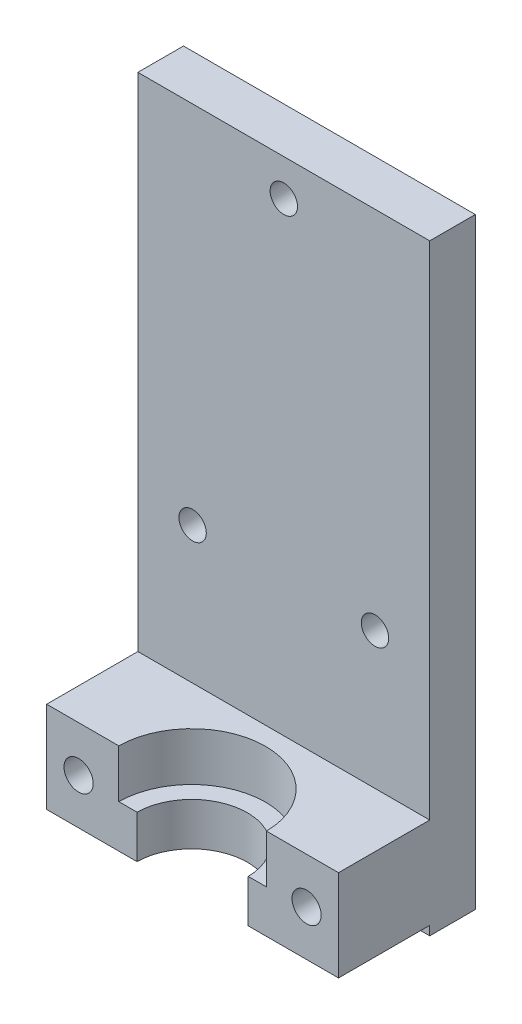
ISO-10303-21;
HEADER;
FILE_DESCRIPTION(('STEP AP214'),'2;1');
FILE_NAME('part.step','',(''),(''),'','','');
FILE_SCHEMA(('AUTOMOTIVE_DESIGN { 1 0 10303 214 1 1 1 1 }'));
ENDSEC;
DATA;
#1=APPLICATION_CONTEXT('core data for automotive mechanical design processes');
#2=APPLICATION_PROTOCOL_DEFINITION('international standard','automotive_design',2000,#1);
#3=PRODUCT_CONTEXT('',#1,'mechanical');
#4=PRODUCT('Part','Part','',(#3));
#5=PRODUCT_RELATED_PRODUCT_CATEGORY('part','',(#4));
#6=PRODUCT_DEFINITION_FORMATION('','',#4);
#7=PRODUCT_DEFINITION_CONTEXT('part definition',#1,'design');
#8=PRODUCT_DEFINITION('design','',#6,#7);
#9=PRODUCT_DEFINITION_SHAPE('','',#8);
#10=(LENGTH_UNIT() NAMED_UNIT(*) SI_UNIT(.MILLI.,.METRE.));
#11=(NAMED_UNIT(*) PLANE_ANGLE_UNIT() SI_UNIT($,.RADIAN.));
#12=(NAMED_UNIT(*) SI_UNIT($,.STERADIAN.) SOLID_ANGLE_UNIT());
#13=UNCERTAINTY_MEASURE_WITH_UNIT(LENGTH_MEASURE(1.E-05),#10,'distance_accuracy_value','');
#14=(GEOMETRIC_REPRESENTATION_CONTEXT(3) GLOBAL_UNCERTAINTY_ASSIGNED_CONTEXT((#13)) GLOBAL_UNIT_ASSIGNED_CONTEXT((#10,
#11,#12)) REPRESENTATION_CONTEXT('',''));
#15=CARTESIAN_POINT('',(0.,0.,0.));
#16=DIRECTION('',(0.,0.,1.));
#17=DIRECTION('',(1.,0.,0.));
#18=AXIS2_PLACEMENT_3D('',#15,#16,#17);
#19=CARTESIAN_POINT('',(3.50000000000001,-60.,0.));
#20=DIRECTION('',(0.,0.,1.));
#21=DIRECTION('',(1.,0.,0.));
#22=AXIS2_PLACEMENT_3D('',#19,#20,#21);
#23=CYLINDRICAL_SURFACE('',#22,1.6);
#24=CARTESIAN_POINT('',(3.50000000000001,-60.,10.));
#25=DIRECTION('',(0.,0.,-1.));
#26=DIRECTION('',(-1.,0.,0.));
#27=AXIS2_PLACEMENT_3D('',#24,#25,#26);
#28=CIRCLE('',#27,1.6);
#29=CARTESIAN_POINT('',(1.90000000000002,-60.,10.));
#30=VERTEX_POINT('',#29);
#31=EDGE_CURVE('E294',#30,#30,#28,.F.);
#32=ORIENTED_EDGE('',*,*,#31,.F.);
#33=EDGE_LOOP('',(#32));
#34=FACE_BOUND('',#33,.T.);
#35=CARTESIAN_POINT('',(3.50000000000001,-60.,15.));
#36=DIRECTION('',(0.,0.,1.));
#37=DIRECTION('',(1.,0.,0.));
#38=AXIS2_PLACEMENT_3D('',#35,#36,#37);
#39=CIRCLE('',#38,1.6);
#40=CARTESIAN_POINT('',(5.10000000000001,-60.,15.));
#41=VERTEX_POINT('',#40);
#42=EDGE_CURVE('E390',#41,#41,#39,.F.);
#43=ORIENTED_EDGE('',*,*,#42,.F.);
#44=EDGE_LOOP('',(#43));
#45=FACE_BOUND('',#44,.T.);
#46=ADVANCED_FACE('F33',(#34,#45),#23,.F.);
#47=CARTESIAN_POINT('',(28.5,-60.,0.));
#48=DIRECTION('',(0.,0.,1.));
#49=DIRECTION('',(1.,0.,0.));
#50=AXIS2_PLACEMENT_3D('',#47,#48,#49);
#51=CYLINDRICAL_SURFACE('',#50,1.6);
#52=CARTESIAN_POINT('',(28.5,-60.,10.));
#53=DIRECTION('',(0.,0.,-1.));
#54=DIRECTION('',(-1.,0.,0.));
#55=AXIS2_PLACEMENT_3D('',#52,#53,#54);
#56=CIRCLE('',#55,1.6);
#57=CARTESIAN_POINT('',(26.9,-60.,10.));
#58=VERTEX_POINT('',#57);
#59=EDGE_CURVE('E289',#58,#58,#56,.F.);
#60=ORIENTED_EDGE('',*,*,#59,.F.);
#61=EDGE_LOOP('',(#60));
#62=FACE_BOUND('',#61,.T.);
#63=CARTESIAN_POINT('',(28.5,-60.,15.));
#64=DIRECTION('',(0.,0.,1.));
#65=DIRECTION('',(1.,0.,0.));
#66=AXIS2_PLACEMENT_3D('',#63,#64,#65);
#67=CIRCLE('',#66,1.6);
#68=CARTESIAN_POINT('',(30.1,-60.,15.));
#69=VERTEX_POINT('',#68);
#70=EDGE_CURVE('E380',#69,#69,#67,.F.);
#71=ORIENTED_EDGE('',*,*,#70,.F.);
#72=EDGE_LOOP('',(#71));
#73=FACE_BOUND('',#72,.T.);
#74=ADVANCED_FACE('F354',(#62,#73),#51,.F.);
#75=CARTESIAN_POINT('',(15.9996874969482,-66.,15.1));
#76=DIRECTION('',(0.,1.,0.));
#77=DIRECTION('',(0.,0.,1.));
#78=AXIS2_PLACEMENT_3D('',#75,#76,#77);
#79=CYLINDRICAL_SURFACE('',#78,6.1);
#80=DIRECTION('',(0.,1.,0.));
#81=VECTOR('',#80,1.);
#82=CARTESIAN_POINT('',(22.098867769739,-66.,15.));
#83=LINE('',#82,#81);
#84=CARTESIAN_POINT('',(22.098867769739,-60.3,15.));
#85=VERTEX_POINT('',#84);
#86=CARTESIAN_POINT('',(22.098867769739,-65.,15.));
#87=VERTEX_POINT('',#86);
#88=EDGE_CURVE('E379',#85,#87,#83,.F.);
#89=ORIENTED_EDGE('',*,*,#88,.F.);
#90=CARTESIAN_POINT('',(15.9996874969482,-60.3,15.1));
#91=DIRECTION('',(0.,1.,0.));
#92=DIRECTION('',(-1.,0.,0.));
#93=AXIS2_PLACEMENT_3D('',#90,#91,#92);
#94=CIRCLE('',#93,6.1);
#95=CARTESIAN_POINT('',(9.90050722415742,-60.3,15.));
#96=VERTEX_POINT('',#95);
#97=EDGE_CURVE('E222',#96,#85,#94,.F.);
#98=ORIENTED_EDGE('',*,*,#97,.F.);
#99=DIRECTION('',(0.,1.,0.));
#100=VECTOR('',#99,1.);
#101=CARTESIAN_POINT('',(9.90050722415742,-66.,15.));
#102=LINE('',#101,#100);
#103=CARTESIAN_POINT('',(9.90050722415742,-65.,15.));
#104=VERTEX_POINT('',#103);
#105=EDGE_CURVE('E384',#104,#96,#102,.T.);
#106=ORIENTED_EDGE('',*,*,#105,.F.);
#107=CARTESIAN_POINT('',(15.9996874969482,-65.,15.1));
#108=DIRECTION('',(0.,1.,0.));
#109=DIRECTION('',(-1.,0.,0.));
#110=AXIS2_PLACEMENT_3D('',#107,#108,#109);
#111=CIRCLE('',#110,6.1);
#112=EDGE_CURVE('E213',#87,#104,#111,.T.);
#113=ORIENTED_EDGE('',*,*,#112,.F.);
#114=EDGE_LOOP('',(#89,#98,#106,#113));
#115=FACE_BOUND('',#114,.T.);
#116=ADVANCED_FACE('F360',(#115),#79,.F.);
#117=CARTESIAN_POINT('',(0.,0.,25.));
#118=DIRECTION('',(1.,0.,0.));
#119=DIRECTION('',(0.,1.,0.));
#120=AXIS2_PLACEMENT_3D('',#117,#118,#119);
#121=PLANE('',#120);
#122=DIRECTION('',(0.,-1.,0.));
#123=VECTOR('',#122,1.);
#124=CARTESIAN_POINT('',(0.,-55.,15.));
#125=LINE('',#124,#123);
#126=CARTESIAN_POINT('',(0.,-55.,15.));
#127=VERTEX_POINT('',#126);
#128=CARTESIAN_POINT('',(0.,-65.,15.));
#129=VERTEX_POINT('',#128);
#130=EDGE_CURVE('E191',#127,#129,#125,.T.);
#131=ORIENTED_EDGE('',*,*,#130,.F.);
#132=DIRECTION('',(0.,0.,1.));
#133=VECTOR('',#132,1.);
#134=CARTESIAN_POINT('',(0.,-55.,25.));
#135=LINE('',#134,#133);
#136=CARTESIAN_POINT('',(0.,-55.,5.00000000000001));
#137=VERTEX_POINT('',#136);
#138=EDGE_CURVE('E238',#137,#127,#135,.T.);
#139=ORIENTED_EDGE('',*,*,#138,.F.);
#140=DIRECTION('',(0.,-1.,0.));
#141=VECTOR('',#140,1.);
#142=CARTESIAN_POINT('',(0.,0.,5.));
#143=LINE('',#142,#141);
#144=CARTESIAN_POINT('',(0.,0.,5.));
#145=VERTEX_POINT('',#144);
#146=EDGE_CURVE('E231',#145,#137,#143,.T.);
#147=ORIENTED_EDGE('',*,*,#146,.F.);
#148=DIRECTION('',(0.,0.,-1.));
#149=VECTOR('',#148,1.);
#150=CARTESIAN_POINT('',(0.,0.,25.));
#151=LINE('',#150,#149);
#152=CARTESIAN_POINT('',(0.,0.,0.));
#153=VERTEX_POINT('',#152);
#154=EDGE_CURVE('E276',#145,#153,#151,.T.);
#155=ORIENTED_EDGE('',*,*,#154,.T.);
#156=DIRECTION('',(0.,-1.,0.));
#157=VECTOR('',#156,1.);
#158=CARTESIAN_POINT('',(0.,0.,0.));
#159=LINE('',#158,#157);
#160=CARTESIAN_POINT('',(0.,-66.,0.));
#161=VERTEX_POINT('',#160);
#162=EDGE_CURVE('E264',#153,#161,#159,.T.);
#163=ORIENTED_EDGE('',*,*,#162,.T.);
#164=DIRECTION('',(0.,0.,-1.));
#165=VECTOR('',#164,1.);
#166=CARTESIAN_POINT('',(0.,-66.,25.));
#167=LINE('',#166,#165);
#168=CARTESIAN_POINT('',(0.,-66.,5.));
#169=VERTEX_POINT('',#168);
#170=EDGE_CURVE('E282',#169,#161,#167,.T.);
#171=ORIENTED_EDGE('',*,*,#170,.F.);
#172=DIRECTION('',(0.,-1.,0.));
#173=VECTOR('',#172,1.);
#174=CARTESIAN_POINT('',(0.,-66.,5.));
#175=LINE('',#174,#173);
#176=CARTESIAN_POINT('',(0.,-65.,5.));
#177=VERTEX_POINT('',#176);
#178=EDGE_CURVE('E218',#177,#169,#175,.T.);
#179=ORIENTED_EDGE('',*,*,#178,.F.);
#180=DIRECTION('',(0.,0.,-1.));
#181=VECTOR('',#180,1.);
#182=CARTESIAN_POINT('',(0.,-65.,25.));
#183=LINE('',#182,#181);
#184=EDGE_CURVE('E209',#129,#177,#183,.T.);
#185=ORIENTED_EDGE('',*,*,#184,.F.);
#186=EDGE_LOOP('',(#131,#139,#147,#155,#163,#171,#179,#185));
#187=FACE_BOUND('',#186,.T.);
#188=ADVANCED_FACE('F35',(#187),#121,.F.);
#189=CARTESIAN_POINT('',(32.,0.,25.));
#190=DIRECTION('',(-1.,0.,0.));
#191=DIRECTION('',(0.,-1.,0.));
#192=AXIS2_PLACEMENT_3D('',#189,#190,#191);
#193=PLANE('',#192);
#194=DIRECTION('',(0.,1.,0.));
#195=VECTOR('',#194,1.);
#196=CARTESIAN_POINT('',(32.,-55.,15.));
#197=LINE('',#196,#195);
#198=CARTESIAN_POINT('',(32.,-65.,15.));
#199=VERTEX_POINT('',#198);
#200=CARTESIAN_POINT('',(32.,-55.,15.));
#201=VERTEX_POINT('',#200);
#202=EDGE_CURVE('E214',#199,#201,#197,.T.);
#203=ORIENTED_EDGE('',*,*,#202,.F.);
#204=DIRECTION('',(0.,0.,-1.));
#205=VECTOR('',#204,1.);
#206=CARTESIAN_POINT('',(32.,-65.,25.));
#207=LINE('',#206,#205);
#208=CARTESIAN_POINT('',(32.,-65.,5.));
#209=VERTEX_POINT('',#208);
#210=EDGE_CURVE('E220',#199,#209,#207,.T.);
#211=ORIENTED_EDGE('',*,*,#210,.T.);
#212=DIRECTION('',(0.,-1.,0.));
#213=VECTOR('',#212,1.);
#214=CARTESIAN_POINT('',(32.,-66.,5.));
#215=LINE('',#214,#213);
#216=CARTESIAN_POINT('',(32.,-66.,5.));
#217=VERTEX_POINT('',#216);
#218=EDGE_CURVE('E225',#209,#217,#215,.T.);
#219=ORIENTED_EDGE('',*,*,#218,.T.);
#220=DIRECTION('',(0.,0.,-1.));
#221=VECTOR('',#220,1.);
#222=CARTESIAN_POINT('',(32.,-66.,25.));
#223=LINE('',#222,#221);
#224=CARTESIAN_POINT('',(32.,-66.,0.));
#225=VERTEX_POINT('',#224);
#226=EDGE_CURVE('E280',#217,#225,#223,.T.);
#227=ORIENTED_EDGE('',*,*,#226,.T.);
#228=DIRECTION('',(0.,1.,0.));
#229=VECTOR('',#228,1.);
#230=CARTESIAN_POINT('',(32.,0.,0.));
#231=LINE('',#230,#229);
#232=CARTESIAN_POINT('',(32.,0.,0.));
#233=VERTEX_POINT('',#232);
#234=EDGE_CURVE('E270',#225,#233,#231,.T.);
#235=ORIENTED_EDGE('',*,*,#234,.T.);
#236=DIRECTION('',(0.,0.,-1.));
#237=VECTOR('',#236,1.);
#238=CARTESIAN_POINT('',(32.,0.,25.));
#239=LINE('',#238,#237);
#240=CARTESIAN_POINT('',(32.,0.,5.));
#241=VERTEX_POINT('',#240);
#242=EDGE_CURVE('E278',#241,#233,#239,.T.);
#243=ORIENTED_EDGE('',*,*,#242,.F.);
#244=DIRECTION('',(0.,-1.,0.));
#245=VECTOR('',#244,1.);
#246=CARTESIAN_POINT('',(32.,0.,5.));
#247=LINE('',#246,#245);
#248=CARTESIAN_POINT('',(32.,-55.,5.00000000000001));
#249=VERTEX_POINT('',#248);
#250=EDGE_CURVE('E234',#241,#249,#247,.T.);
#251=ORIENTED_EDGE('',*,*,#250,.T.);
#252=DIRECTION('',(0.,0.,1.));
#253=VECTOR('',#252,1.);
#254=CARTESIAN_POINT('',(32.,-55.,25.));
#255=LINE('',#254,#253);
#256=EDGE_CURVE('E237',#249,#201,#255,.T.);
#257=ORIENTED_EDGE('',*,*,#256,.T.);
#258=EDGE_LOOP('',(#203,#211,#219,#227,#235,#243,#251,#257));
#259=FACE_BOUND('',#258,.T.);
#260=ADVANCED_FACE('F316',(#259),#193,.F.);
#261=CARTESIAN_POINT('',(32.,-55.,25.));
#262=DIRECTION('',(0.,-1.,0.));
#263=DIRECTION('',(1.,0.,0.));
#264=AXIS2_PLACEMENT_3D('',#261,#262,#263);
#265=PLANE('',#264);
#266=DIRECTION('',(-1.,0.,0.));
#267=VECTOR('',#266,1.);
#268=CARTESIAN_POINT('',(0.,-55.,15.));
#269=LINE('',#268,#267);
#270=CARTESIAN_POINT('',(24.0990701894748,-55.,15.));
#271=VERTEX_POINT('',#270);
#272=EDGE_CURVE('E47',#201,#271,#269,.T.);
#273=ORIENTED_EDGE('',*,*,#272,.F.);
#274=ORIENTED_EDGE('',*,*,#256,.F.);
#275=DIRECTION('',(-1.,0.,0.));
#276=VECTOR('',#275,1.);
#277=CARTESIAN_POINT('',(32.,-55.,5.00000000000001));
#278=LINE('',#277,#276);
#279=EDGE_CURVE('E245',#249,#137,#278,.T.);
#280=ORIENTED_EDGE('',*,*,#279,.T.);
#281=ORIENTED_EDGE('',*,*,#138,.T.);
#282=CARTESIAN_POINT('',(7.90030480442156,-55.,15.));
#283=VERTEX_POINT('',#282);
#284=EDGE_CURVE('E198',#283,#127,#269,.T.);
#285=ORIENTED_EDGE('',*,*,#284,.F.);
#286=CARTESIAN_POINT('',(15.9996874969482,-55.,15.1));
#287=DIRECTION('',(0.,1.,0.));
#288=DIRECTION('',(-1.,0.,0.));
#289=AXIS2_PLACEMENT_3D('',#286,#287,#288);
#290=CIRCLE('',#289,8.1);
#291=EDGE_CURVE('E292',#271,#283,#290,.T.);
#292=ORIENTED_EDGE('',*,*,#291,.F.);
#293=EDGE_LOOP('',(#273,#274,#280,#281,#285,#292));
#294=FACE_BOUND('',#293,.T.);
#295=ADVANCED_FACE('F304',(#294),#265,.F.);
#296=CARTESIAN_POINT('',(32.,-65.,25.));
#297=DIRECTION('',(0.,1.,0.));
#298=DIRECTION('',(-1.,0.,0.));
#299=AXIS2_PLACEMENT_3D('',#296,#297,#298);
#300=PLANE('',#299);
#301=DIRECTION('',(1.,0.,0.));
#302=VECTOR('',#301,1.);
#303=CARTESIAN_POINT('',(0.,-65.,15.));
#304=LINE('',#303,#302);
#305=EDGE_CURVE('E195',#129,#104,#304,.T.);
#306=ORIENTED_EDGE('',*,*,#305,.F.);
#307=ORIENTED_EDGE('',*,*,#184,.T.);
#308=DIRECTION('',(-1.,0.,0.));
#309=VECTOR('',#308,1.);
#310=CARTESIAN_POINT('',(32.,-65.,5.));
#311=LINE('',#310,#309);
#312=EDGE_CURVE('E232',#209,#177,#311,.T.);
#313=ORIENTED_EDGE('',*,*,#312,.F.);
#314=ORIENTED_EDGE('',*,*,#210,.F.);
#315=EDGE_CURVE('E203',#87,#199,#304,.T.);
#316=ORIENTED_EDGE('',*,*,#315,.F.);
#317=ORIENTED_EDGE('',*,*,#112,.T.);
#318=EDGE_LOOP('',(#306,#307,#313,#314,#316,#317));
#319=FACE_BOUND('',#318,.T.);
#320=ADVANCED_FACE('F207',(#319),#300,.F.);
#321=CARTESIAN_POINT('',(15.9996874969482,-60.3,15.1));
#322=DIRECTION('',(0.,1.,0.));
#323=DIRECTION('',(-1.,0.,0.));
#324=AXIS2_PLACEMENT_3D('',#321,#322,#323);
#325=PLANE('',#324);
#326=CARTESIAN_POINT('',(15.9996874969482,-60.3,15.1));
#327=DIRECTION('',(0.,1.,0.));
#328=DIRECTION('',(-1.,0.,0.));
#329=AXIS2_PLACEMENT_3D('',#326,#327,#328);
#330=CIRCLE('',#329,8.1);
#331=CARTESIAN_POINT('',(24.0990701894748,-60.3,15.));
#332=VERTEX_POINT('',#331);
#333=CARTESIAN_POINT('',(7.90030480442156,-60.3,15.));
#334=VERTEX_POINT('',#333);
#335=EDGE_CURVE('E288',#332,#334,#330,.T.);
#336=ORIENTED_EDGE('',*,*,#335,.T.);
#337=DIRECTION('',(1.,0.,0.));
#338=VECTOR('',#337,1.);
#339=CARTESIAN_POINT('',(15.9996874969482,-60.3,15.));
#340=LINE('',#339,#338);
#341=EDGE_CURVE('E55',#334,#96,#340,.T.);
#342=ORIENTED_EDGE('',*,*,#341,.T.);
#343=ORIENTED_EDGE('',*,*,#97,.T.);
#344=EDGE_CURVE('E381',#85,#332,#340,.T.);
#345=ORIENTED_EDGE('',*,*,#344,.T.);
#346=EDGE_LOOP('',(#336,#342,#343,#345));
#347=FACE_BOUND('',#346,.T.);
#348=ADVANCED_FACE('F367',(#347),#325,.T.);
#349=CARTESIAN_POINT('',(15.9996874969482,-60.3,15.1));
#350=DIRECTION('',(0.,1.,0.));
#351=DIRECTION('',(-1.,0.,0.));
#352=AXIS2_PLACEMENT_3D('',#349,#350,#351);
#353=CYLINDRICAL_SURFACE('',#352,8.1);
#354=DIRECTION('',(0.,1.,0.));
#355=VECTOR('',#354,1.);
#356=CARTESIAN_POINT('',(24.0990701894748,-60.3,15.));
#357=LINE('',#356,#355);
#358=EDGE_CURVE('E11',#271,#332,#357,.F.);
#359=ORIENTED_EDGE('',*,*,#358,.F.);
#360=ORIENTED_EDGE('',*,*,#291,.T.);
#361=DIRECTION('',(0.,1.,0.));
#362=VECTOR('',#361,1.);
#363=CARTESIAN_POINT('',(7.90030480442156,-60.3,15.));
#364=LINE('',#363,#362);
#365=EDGE_CURVE('E41',#334,#283,#364,.T.);
#366=ORIENTED_EDGE('',*,*,#365,.F.);
#367=ORIENTED_EDGE('',*,*,#335,.F.);
#368=EDGE_LOOP('',(#359,#360,#366,#367));
#369=FACE_BOUND('',#368,.T.);
#370=ADVANCED_FACE('F306',(#369),#353,.F.);
#371=CARTESIAN_POINT('',(0.,0.,0.));
#372=DIRECTION('',(0.,0.,1.));
#373=DIRECTION('',(1.,0.,0.));
#374=AXIS2_PLACEMENT_3D('',#371,#372,#373);
#375=PLANE('',#374);
#376=DIRECTION('',(0.556468039010961,-0.830869015885955,0.));
#377=VECTOR('',#376,1.);
#378=CARTESIAN_POINT('',(4.84602494918087,-57.2630826033322,0.));
#379=LINE('',#378,#377);
#380=CARTESIAN_POINT('',(4.84602494918086,-57.2630826033322,0.));
#381=VERTEX_POINT('',#380);
#382=CARTESIAN_POINT('',(6.54325246816431,-59.7972331017844,0.));
#383=VERTEX_POINT('',#382);
#384=EDGE_CURVE('E415',#381,#383,#379,.T.);
#385=ORIENTED_EDGE('',*,*,#384,.F.);
#386=DIRECTION('',(0.997787694480094,0.0664809502346248,0.));
#387=VECTOR('',#386,1.);
#388=CARTESIAN_POINT('',(1.80277248101657,-57.4658495015478,0.));
#389=LINE('',#388,#387);
#390=CARTESIAN_POINT('',(1.80277248101657,-57.4658495015478,0.));
#391=VERTEX_POINT('',#390);
#392=EDGE_CURVE('E393',#391,#381,#389,.T.);
#393=ORIENTED_EDGE('',*,*,#392,.F.);
#394=DIRECTION('',(0.441319655469133,0.89734996612058,0.));
#395=VECTOR('',#394,1.);
#396=CARTESIAN_POINT('',(0.456747531835722,-60.2027668982156,0.));
#397=LINE('',#396,#395);
#398=CARTESIAN_POINT('',(0.456747531835722,-60.2027668982156,0.));
#399=VERTEX_POINT('',#398);
#400=EDGE_CURVE('E398',#399,#391,#397,.T.);
#401=ORIENTED_EDGE('',*,*,#400,.F.);
#402=DIRECTION('',(-0.556468039010961,0.830869015885956,0.));
#403=VECTOR('',#402,1.);
#404=CARTESIAN_POINT('',(2.15397505081915,-62.7369173966678,0.));
#405=LINE('',#404,#403);
#406=CARTESIAN_POINT('',(2.15397505081915,-62.7369173966678,0.));
#407=VERTEX_POINT('',#406);
#408=EDGE_CURVE('E424',#407,#399,#405,.T.);
#409=ORIENTED_EDGE('',*,*,#408,.F.);
#410=DIRECTION('',(-0.997787694480094,-0.0664809502346245,0.));
#411=VECTOR('',#410,1.);
#412=CARTESIAN_POINT('',(5.19722751898346,-62.5341504984521,0.));
#413=LINE('',#412,#411);
#414=CARTESIAN_POINT('',(5.19722751898346,-62.5341504984521,0.));
#415=VERTEX_POINT('',#414);
#416=EDGE_CURVE('E421',#415,#407,#413,.T.);
#417=ORIENTED_EDGE('',*,*,#416,.F.);
#418=DIRECTION('',(-0.441319655469132,-0.89734996612058,0.));
#419=VECTOR('',#418,1.);
#420=CARTESIAN_POINT('',(6.54325246816431,-59.7972331017844,0.));
#421=LINE('',#420,#419);
#422=EDGE_CURVE('E418',#383,#415,#421,.T.);
#423=ORIENTED_EDGE('',*,*,#422,.F.);
#424=EDGE_LOOP('',(#385,#393,#401,#409,#417,#423));
#425=FACE_BOUND('',#424,.T.);
#426=DIRECTION('',(0.995936983075885,-0.0900529052374489,0.));
#427=VECTOR('',#426,1.);
#428=CARTESIAN_POINT('',(27.219059816851,-57.2320237993808,0.));
#429=LINE('',#428,#427);
#430=CARTESIAN_POINT('',(27.219059816851,-57.2320237993808,0.));
#431=VERTEX_POINT('',#430);
#432=CARTESIAN_POINT('',(30.2566676152324,-57.506685160355,0.));
#433=VERTEX_POINT('',#432);
#434=EDGE_CURVE('E461',#431,#433,#429,.T.);
#435=ORIENTED_EDGE('',*,*,#434,.F.);
#436=DIRECTION('',(0.575956595158167,0.817480275293424,0.));
#437=VECTOR('',#436,1.);
#438=CARTESIAN_POINT('',(25.4623922016186,-59.7253386390258,0.));
#439=LINE('',#438,#437);
#440=CARTESIAN_POINT('',(25.4623922016186,-59.7253386390258,0.));
#441=VERTEX_POINT('',#440);
#442=EDGE_CURVE('E296',#441,#431,#439,.T.);
#443=ORIENTED_EDGE('',*,*,#442,.F.);
#444=DIRECTION('',(-0.419980387917718,0.907533180530874,0.));
#445=VECTOR('',#444,1.);
#446=CARTESIAN_POINT('',(26.7433323847676,-62.4933148396449,0.));
#447=LINE('',#446,#445);
#448=CARTESIAN_POINT('',(26.7433323847676,-62.4933148396449,0.));
#449=VERTEX_POINT('',#448);
#450=EDGE_CURVE('E444',#449,#441,#447,.T.);
#451=ORIENTED_EDGE('',*,*,#450,.F.);
#452=DIRECTION('',(-0.995936983075885,0.0900529052374445,0.));
#453=VECTOR('',#452,1.);
#454=CARTESIAN_POINT('',(29.780940183149,-62.7679762006191,0.));
#455=LINE('',#454,#453);
#456=CARTESIAN_POINT('',(29.780940183149,-62.7679762006191,0.));
#457=VERTEX_POINT('',#456);
#458=EDGE_CURVE('E470',#457,#449,#455,.T.);
#459=ORIENTED_EDGE('',*,*,#458,.F.);
#460=DIRECTION('',(-0.575956595158171,-0.81748027529342,0.));
#461=VECTOR('',#460,1.);
#462=CARTESIAN_POINT('',(31.5376077983815,-60.2746613609742,0.));
#463=LINE('',#462,#461);
#464=CARTESIAN_POINT('',(31.5376077983815,-60.2746613609742,0.));
#465=VERTEX_POINT('',#464);
#466=EDGE_CURVE('E467',#465,#457,#463,.T.);
#467=ORIENTED_EDGE('',*,*,#466,.F.);
#468=DIRECTION('',(0.419980387917722,-0.907533180530872,0.));
#469=VECTOR('',#468,1.);
#470=CARTESIAN_POINT('',(30.2566676152324,-57.506685160355,0.));
#471=LINE('',#470,#469);
#472=EDGE_CURVE('E464',#433,#465,#471,.T.);
#473=ORIENTED_EDGE('',*,*,#472,.F.);
#474=EDGE_LOOP('',(#435,#443,#451,#459,#467,#473));
#475=FACE_BOUND('',#474,.T.);
#476=ORIENTED_EDGE('',*,*,#162,.F.);
#477=DIRECTION('',(-1.,0.,0.));
#478=VECTOR('',#477,1.);
#479=CARTESIAN_POINT('',(0.,0.,0.));
#480=LINE('',#479,#478);
#481=EDGE_CURVE('E273',#233,#153,#480,.T.);
#482=ORIENTED_EDGE('',*,*,#481,.F.);
#483=ORIENTED_EDGE('',*,*,#234,.F.);
#484=DIRECTION('',(1.,0.,0.));
#485=VECTOR('',#484,1.);
#486=CARTESIAN_POINT('',(0.,-66.,0.));
#487=LINE('',#486,#485);
#488=EDGE_CURVE('E267',#161,#225,#487,.T.);
#489=ORIENTED_EDGE('',*,*,#488,.F.);
#490=EDGE_LOOP('',(#476,#482,#483,#489));
#491=FACE_BOUND('',#490,.T.);
#492=CARTESIAN_POINT('',(16.,-4.,0.));
#493=DIRECTION('',(0.,0.,1.));
#494=DIRECTION('',(1.,0.,0.));
#495=AXIS2_PLACEMENT_3D('',#492,#493,#494);
#496=CIRCLE('',#495,1.5);
#497=CARTESIAN_POINT('',(17.5,-4.,0.));
#498=VERTEX_POINT('',#497);
#499=EDGE_CURVE('E261',#498,#498,#496,.T.);
#500=ORIENTED_EDGE('',*,*,#499,.T.);
#501=EDGE_LOOP('',(#500));
#502=FACE_BOUND('',#501,.T.);
#503=CARTESIAN_POINT('',(6.00000000000001,-40.,0.));
#504=DIRECTION('',(0.,0.,1.));
#505=DIRECTION('',(1.,0.,0.));
#506=AXIS2_PLACEMENT_3D('',#503,#504,#505);
#507=CIRCLE('',#506,1.5);
#508=CARTESIAN_POINT('',(7.50000000000001,-40.,0.));
#509=VERTEX_POINT('',#508);
#510=EDGE_CURVE('E258',#509,#509,#507,.T.);
#511=ORIENTED_EDGE('',*,*,#510,.T.);
#512=EDGE_LOOP('',(#511));
#513=FACE_BOUND('',#512,.T.);
#514=CARTESIAN_POINT('',(26.,-40.,0.));
#515=DIRECTION('',(0.,0.,1.));
#516=DIRECTION('',(1.,0.,0.));
#517=AXIS2_PLACEMENT_3D('',#514,#515,#516);
#518=CIRCLE('',#517,1.5);
#519=CARTESIAN_POINT('',(27.5,-40.,0.));
#520=VERTEX_POINT('',#519);
#521=EDGE_CURVE('E255',#520,#520,#518,.T.);
#522=ORIENTED_EDGE('',*,*,#521,.T.);
#523=EDGE_LOOP('',(#522));
#524=FACE_BOUND('',#523,.T.);
#525=ADVANCED_FACE('F325',(#425,#475,#491,#502,#513,#524),#375,.F.);
#526=CARTESIAN_POINT('',(0.,-66.,25.));
#527=DIRECTION('',(0.,1.,0.));
#528=DIRECTION('',(0.,0.,1.));
#529=AXIS2_PLACEMENT_3D('',#526,#527,#528);
#530=PLANE('',#529);
#531=ORIENTED_EDGE('',*,*,#226,.F.);
#532=DIRECTION('',(-1.,0.,0.));
#533=VECTOR('',#532,1.);
#534=CARTESIAN_POINT('',(32.,-66.,5.));
#535=LINE('',#534,#533);
#536=EDGE_CURVE('E228',#217,#169,#535,.T.);
#537=ORIENTED_EDGE('',*,*,#536,.T.);
#538=ORIENTED_EDGE('',*,*,#170,.T.);
#539=ORIENTED_EDGE('',*,*,#488,.T.);
#540=EDGE_LOOP('',(#531,#537,#538,#539));
#541=FACE_BOUND('',#540,.T.);
#542=ADVANCED_FACE('F319',(#541),#530,.F.);
#543=CARTESIAN_POINT('',(0.,0.,25.));
#544=DIRECTION('',(0.,-1.,0.));
#545=DIRECTION('',(0.,0.,-1.));
#546=AXIS2_PLACEMENT_3D('',#543,#544,#545);
#547=PLANE('',#546);
#548=ORIENTED_EDGE('',*,*,#154,.F.);
#549=DIRECTION('',(-1.,0.,0.));
#550=VECTOR('',#549,1.);
#551=CARTESIAN_POINT('',(32.,0.,5.));
#552=LINE('',#551,#550);
#553=EDGE_CURVE('E241',#241,#145,#552,.T.);
#554=ORIENTED_EDGE('',*,*,#553,.F.);
#555=ORIENTED_EDGE('',*,*,#242,.T.);
#556=ORIENTED_EDGE('',*,*,#481,.T.);
#557=EDGE_LOOP('',(#548,#554,#555,#556));
#558=FACE_BOUND('',#557,.T.);
#559=ADVANCED_FACE('F331',(#558),#547,.F.);
#560=CARTESIAN_POINT('',(16.,-4.,25.));
#561=DIRECTION('',(0.,0.,-1.));
#562=DIRECTION('',(-1.,0.,0.));
#563=AXIS2_PLACEMENT_3D('',#560,#561,#562);
#564=CYLINDRICAL_SURFACE('',#563,1.5);
#565=CARTESIAN_POINT('',(16.,-4.,5.));
#566=DIRECTION('',(0.,0.,-1.));
#567=DIRECTION('',(0.,1.,0.));
#568=AXIS2_PLACEMENT_3D('',#565,#566,#567);
#569=CIRCLE('',#568,1.5);
#570=CARTESIAN_POINT('',(16.,-2.5,5.));
#571=VERTEX_POINT('',#570);
#572=EDGE_CURVE('E252',#571,#571,#569,.T.);
#573=ORIENTED_EDGE('',*,*,#572,.F.);
#574=EDGE_LOOP('',(#573));
#575=FACE_BOUND('',#574,.T.);
#576=ORIENTED_EDGE('',*,*,#499,.F.);
#577=EDGE_LOOP('',(#576));
#578=FACE_BOUND('',#577,.T.);
#579=ADVANCED_FACE('F742',(#575,#578),#564,.F.);
#580=CARTESIAN_POINT('',(6.00000000000001,-40.,25.));
#581=DIRECTION('',(0.,0.,-1.));
#582=DIRECTION('',(-1.,0.,0.));
#583=AXIS2_PLACEMENT_3D('',#580,#581,#582);
#584=CYLINDRICAL_SURFACE('',#583,1.5);
#585=CARTESIAN_POINT('',(6.00000000000001,-40.,5.));
#586=DIRECTION('',(0.,0.,-1.));
#587=DIRECTION('',(0.,1.,0.));
#588=AXIS2_PLACEMENT_3D('',#585,#586,#587);
#589=CIRCLE('',#588,1.5);
#590=CARTESIAN_POINT('',(6.00000000000001,-38.5,5.));
#591=VERTEX_POINT('',#590);
#592=EDGE_CURVE('E249',#591,#591,#589,.T.);
#593=ORIENTED_EDGE('',*,*,#592,.F.);
#594=EDGE_LOOP('',(#593));
#595=FACE_BOUND('',#594,.T.);
#596=ORIENTED_EDGE('',*,*,#510,.F.);
#597=EDGE_LOOP('',(#596));
#598=FACE_BOUND('',#597,.T.);
#599=ADVANCED_FACE('F732',(#595,#598),#584,.F.);
#600=CARTESIAN_POINT('',(26.,-40.,25.));
#601=DIRECTION('',(0.,0.,-1.));
#602=DIRECTION('',(-1.,0.,0.));
#603=AXIS2_PLACEMENT_3D('',#600,#601,#602);
#604=CYLINDRICAL_SURFACE('',#603,1.5);
#605=CARTESIAN_POINT('',(26.,-40.,5.));
#606=DIRECTION('',(0.,0.,-1.));
#607=DIRECTION('',(0.,1.,0.));
#608=AXIS2_PLACEMENT_3D('',#605,#606,#607);
#609=CIRCLE('',#608,1.5);
#610=CARTESIAN_POINT('',(26.,-38.5,5.));
#611=VERTEX_POINT('',#610);
#612=EDGE_CURVE('E247',#611,#611,#609,.T.);
#613=ORIENTED_EDGE('',*,*,#612,.F.);
#614=EDGE_LOOP('',(#613));
#615=FACE_BOUND('',#614,.T.);
#616=ORIENTED_EDGE('',*,*,#521,.F.);
#617=EDGE_LOOP('',(#616));
#618=FACE_BOUND('',#617,.T.);
#619=ADVANCED_FACE('F348',(#615,#618),#604,.F.);
#620=CARTESIAN_POINT('',(32.,0.,5.));
#621=DIRECTION('',(0.,0.,-1.));
#622=DIRECTION('',(0.,1.,0.));
#623=AXIS2_PLACEMENT_3D('',#620,#621,#622);
#624=PLANE('',#623);
#625=ORIENTED_EDGE('',*,*,#572,.T.);
#626=EDGE_LOOP('',(#625));
#627=FACE_BOUND('',#626,.T.);
#628=ORIENTED_EDGE('',*,*,#592,.T.);
#629=EDGE_LOOP('',(#628));
#630=FACE_BOUND('',#629,.T.);
#631=ORIENTED_EDGE('',*,*,#612,.T.);
#632=EDGE_LOOP('',(#631));
#633=FACE_BOUND('',#632,.T.);
#634=ORIENTED_EDGE('',*,*,#146,.T.);
#635=ORIENTED_EDGE('',*,*,#279,.F.);
#636=ORIENTED_EDGE('',*,*,#250,.F.);
#637=ORIENTED_EDGE('',*,*,#553,.T.);
#638=EDGE_LOOP('',(#634,#635,#636,#637));
#639=FACE_BOUND('',#638,.T.);
#640=ADVANCED_FACE('F334',(#627,#630,#633,#639),#624,.F.);
#641=CARTESIAN_POINT('',(32.,-66.,5.));
#642=DIRECTION('',(0.,0.,-1.));
#643=DIRECTION('',(-1.,0.,0.));
#644=AXIS2_PLACEMENT_3D('',#641,#642,#643);
#645=PLANE('',#644);
#646=ORIENTED_EDGE('',*,*,#178,.T.);
#647=ORIENTED_EDGE('',*,*,#536,.F.);
#648=ORIENTED_EDGE('',*,*,#218,.F.);
#649=ORIENTED_EDGE('',*,*,#312,.T.);
#650=EDGE_LOOP('',(#646,#647,#648,#649));
#651=FACE_BOUND('',#650,.T.);
#652=ADVANCED_FACE('F337',(#651),#645,.F.);
#653=CARTESIAN_POINT('',(0.,0.,10.));
#654=DIRECTION('',(0.,0.,-1.));
#655=DIRECTION('',(-1.,0.,0.));
#656=AXIS2_PLACEMENT_3D('',#653,#654,#655);
#657=PLANE('',#656);
#658=DIRECTION('',(0.575956595158167,0.817480275293424,0.));
#659=VECTOR('',#658,1.);
#660=CARTESIAN_POINT('',(25.4623922016186,-59.7253386390258,10.));
#661=LINE('',#660,#659);
#662=CARTESIAN_POINT('',(25.4623922016186,-59.7253386390258,10.));
#663=VERTEX_POINT('',#662);
#664=CARTESIAN_POINT('',(27.219059816851,-57.2320237993808,10.));
#665=VERTEX_POINT('',#664);
#666=EDGE_CURVE('E440',#663,#665,#661,.T.);
#667=ORIENTED_EDGE('',*,*,#666,.T.);
#668=DIRECTION('',(0.995936983075885,-0.0900529052374489,0.));
#669=VECTOR('',#668,1.);
#670=CARTESIAN_POINT('',(27.219059816851,-57.2320237993808,10.));
#671=LINE('',#670,#669);
#672=CARTESIAN_POINT('',(30.2566676152324,-57.506685160355,10.));
#673=VERTEX_POINT('',#672);
#674=EDGE_CURVE('E443',#665,#673,#671,.T.);
#675=ORIENTED_EDGE('',*,*,#674,.T.);
#676=DIRECTION('',(0.419980387917722,-0.907533180530872,0.));
#677=VECTOR('',#676,1.);
#678=CARTESIAN_POINT('',(30.2566676152324,-57.506685160355,10.));
#679=LINE('',#678,#677);
#680=CARTESIAN_POINT('',(31.5376077983815,-60.2746613609742,10.));
#681=VERTEX_POINT('',#680);
#682=EDGE_CURVE('E447',#673,#681,#679,.T.);
#683=ORIENTED_EDGE('',*,*,#682,.T.);
#684=DIRECTION('',(-0.575956595158171,-0.81748027529342,0.));
#685=VECTOR('',#684,1.);
#686=CARTESIAN_POINT('',(31.5376077983815,-60.2746613609742,10.));
#687=LINE('',#686,#685);
#688=CARTESIAN_POINT('',(29.780940183149,-62.7679762006191,10.));
#689=VERTEX_POINT('',#688);
#690=EDGE_CURVE('E450',#681,#689,#687,.T.);
#691=ORIENTED_EDGE('',*,*,#690,.T.);
#692=DIRECTION('',(-0.995936983075885,0.0900529052374445,0.));
#693=VECTOR('',#692,1.);
#694=CARTESIAN_POINT('',(29.780940183149,-62.7679762006191,10.));
#695=LINE('',#694,#693);
#696=CARTESIAN_POINT('',(26.7433323847676,-62.4933148396449,10.));
#697=VERTEX_POINT('',#696);
#698=EDGE_CURVE('E453',#689,#697,#695,.T.);
#699=ORIENTED_EDGE('',*,*,#698,.T.);
#700=DIRECTION('',(-0.419980387917718,0.907533180530874,0.));
#701=VECTOR('',#700,1.);
#702=CARTESIAN_POINT('',(26.7433323847676,-62.4933148396449,10.));
#703=LINE('',#702,#701);
#704=EDGE_CURVE('E456',#697,#663,#703,.T.);
#705=ORIENTED_EDGE('',*,*,#704,.T.);
#706=EDGE_LOOP('',(#667,#675,#683,#691,#699,#705));
#707=FACE_BOUND('',#706,.T.);
#708=ORIENTED_EDGE('',*,*,#59,.T.);
#709=EDGE_LOOP('',(#708));
#710=FACE_BOUND('',#709,.T.);
#711=ADVANCED_FACE('F339',(#707,#710),#657,.T.);
#712=CARTESIAN_POINT('',(25.4623922016186,-59.7253386390258,10.));
#713=DIRECTION('',(-0.817480275293424,0.575956595158167,0.));
#714=DIRECTION('',(-0.575956595158167,-0.817480275293424,0.));
#715=AXIS2_PLACEMENT_3D('',#712,#713,#714);
#716=PLANE('',#715);
#717=ORIENTED_EDGE('',*,*,#442,.T.);
#718=DIRECTION('',(0.,0.,-1.));
#719=VECTOR('',#718,1.);
#720=CARTESIAN_POINT('',(27.219059816851,-57.2320237993808,10.));
#721=LINE('',#720,#719);
#722=EDGE_CURVE('E459',#665,#431,#721,.T.);
#723=ORIENTED_EDGE('',*,*,#722,.F.);
#724=ORIENTED_EDGE('',*,*,#666,.F.);
#725=DIRECTION('',(0.,0.,-1.));
#726=VECTOR('',#725,1.);
#727=CARTESIAN_POINT('',(25.4623922016186,-59.7253386390258,10.));
#728=LINE('',#727,#726);
#729=EDGE_CURVE('E293',#663,#441,#728,.T.);
#730=ORIENTED_EDGE('',*,*,#729,.T.);
#731=EDGE_LOOP('',(#717,#723,#724,#730));
#732=FACE_BOUND('',#731,.T.);
#733=ADVANCED_FACE('F345',(#732),#716,.F.);
#734=CARTESIAN_POINT('',(26.7433323847676,-62.4933148396449,10.));
#735=DIRECTION('',(-0.907533180530874,-0.419980387917718,0.));
#736=DIRECTION('',(0.419980387917718,-0.907533180530874,0.));
#737=AXIS2_PLACEMENT_3D('',#734,#735,#736);
#738=PLANE('',#737);
#739=ORIENTED_EDGE('',*,*,#450,.T.);
#740=ORIENTED_EDGE('',*,*,#729,.F.);
#741=ORIENTED_EDGE('',*,*,#704,.F.);
#742=DIRECTION('',(0.,0.,-1.));
#743=VECTOR('',#742,1.);
#744=CARTESIAN_POINT('',(26.7433323847676,-62.4933148396449,10.));
#745=LINE('',#744,#743);
#746=EDGE_CURVE('E476',#697,#449,#745,.T.);
#747=ORIENTED_EDGE('',*,*,#746,.T.);
#748=EDGE_LOOP('',(#739,#740,#741,#747));
#749=FACE_BOUND('',#748,.T.);
#750=ADVANCED_FACE('F503',(#749),#738,.F.);
#751=CARTESIAN_POINT('',(29.780940183149,-62.7679762006191,10.));
#752=DIRECTION('',(-0.0900529052374445,-0.995936983075885,0.));
#753=DIRECTION('',(0.995936983075885,-0.0900529052374445,0.));
#754=AXIS2_PLACEMENT_3D('',#751,#752,#753);
#755=PLANE('',#754);
#756=ORIENTED_EDGE('',*,*,#458,.T.);
#757=ORIENTED_EDGE('',*,*,#746,.F.);
#758=ORIENTED_EDGE('',*,*,#698,.F.);
#759=DIRECTION('',(0.,0.,-1.));
#760=VECTOR('',#759,1.);
#761=CARTESIAN_POINT('',(29.780940183149,-62.7679762006191,10.));
#762=LINE('',#761,#760);
#763=EDGE_CURVE('E478',#689,#457,#762,.T.);
#764=ORIENTED_EDGE('',*,*,#763,.T.);
#765=EDGE_LOOP('',(#756,#757,#758,#764));
#766=FACE_BOUND('',#765,.T.);
#767=ADVANCED_FACE('F505',(#766),#755,.F.);
#768=CARTESIAN_POINT('',(31.5376077983815,-60.2746613609742,10.));
#769=DIRECTION('',(0.81748027529342,-0.575956595158171,0.));
#770=DIRECTION('',(0.575956595158171,0.81748027529342,0.));
#771=AXIS2_PLACEMENT_3D('',#768,#769,#770);
#772=PLANE('',#771);
#773=ORIENTED_EDGE('',*,*,#466,.T.);
#774=ORIENTED_EDGE('',*,*,#763,.F.);
#775=ORIENTED_EDGE('',*,*,#690,.F.);
#776=DIRECTION('',(0.,0.,-1.));
#777=VECTOR('',#776,1.);
#778=CARTESIAN_POINT('',(31.5376077983815,-60.2746613609742,10.));
#779=LINE('',#778,#777);
#780=EDGE_CURVE('E480',#681,#465,#779,.T.);
#781=ORIENTED_EDGE('',*,*,#780,.T.);
#782=EDGE_LOOP('',(#773,#774,#775,#781));
#783=FACE_BOUND('',#782,.T.);
#784=ADVANCED_FACE('F508',(#783),#772,.F.);
#785=CARTESIAN_POINT('',(30.2566676152324,-57.506685160355,10.));
#786=DIRECTION('',(0.907533180530872,0.419980387917722,0.));
#787=DIRECTION('',(-0.419980387917722,0.907533180530872,0.));
#788=AXIS2_PLACEMENT_3D('',#785,#786,#787);
#789=PLANE('',#788);
#790=ORIENTED_EDGE('',*,*,#472,.T.);
#791=ORIENTED_EDGE('',*,*,#780,.F.);
#792=ORIENTED_EDGE('',*,*,#682,.F.);
#793=DIRECTION('',(0.,0.,-1.));
#794=VECTOR('',#793,1.);
#795=CARTESIAN_POINT('',(30.2566676152324,-57.506685160355,10.));
#796=LINE('',#795,#794);
#797=EDGE_CURVE('E482',#673,#433,#796,.T.);
#798=ORIENTED_EDGE('',*,*,#797,.T.);
#799=EDGE_LOOP('',(#790,#791,#792,#798));
#800=FACE_BOUND('',#799,.T.);
#801=ADVANCED_FACE('F497',(#800),#789,.F.);
#802=CARTESIAN_POINT('',(27.219059816851,-57.2320237993808,10.));
#803=DIRECTION('',(0.0900529052374489,0.995936983075885,0.));
#804=DIRECTION('',(-0.995936983075885,0.0900529052374489,0.));
#805=AXIS2_PLACEMENT_3D('',#802,#803,#804);
#806=PLANE('',#805);
#807=ORIENTED_EDGE('',*,*,#434,.T.);
#808=ORIENTED_EDGE('',*,*,#797,.F.);
#809=ORIENTED_EDGE('',*,*,#674,.F.);
#810=ORIENTED_EDGE('',*,*,#722,.T.);
#811=EDGE_LOOP('',(#807,#808,#809,#810));
#812=FACE_BOUND('',#811,.T.);
#813=ADVANCED_FACE('F487',(#812),#806,.F.);
#814=CARTESIAN_POINT('',(0.,0.,10.));
#815=DIRECTION('',(0.,0.,-1.));
#816=DIRECTION('',(-1.,0.,0.));
#817=AXIS2_PLACEMENT_3D('',#814,#815,#816);
#818=PLANE('',#817);
#819=DIRECTION('',(0.997787694480094,0.0664809502346248,0.));
#820=VECTOR('',#819,1.);
#821=CARTESIAN_POINT('',(1.80277248101657,-57.4658495015478,10.));
#822=LINE('',#821,#820);
#823=CARTESIAN_POINT('',(1.80277248101657,-57.4658495015478,10.));
#824=VERTEX_POINT('',#823);
#825=CARTESIAN_POINT('',(4.84602494918087,-57.2630826033322,10.));
#826=VERTEX_POINT('',#825);
#827=EDGE_CURVE('E394',#824,#826,#822,.T.);
#828=ORIENTED_EDGE('',*,*,#827,.T.);
#829=DIRECTION('',(0.556468039010961,-0.830869015885955,0.));
#830=VECTOR('',#829,1.);
#831=CARTESIAN_POINT('',(4.84602494918087,-57.2630826033322,10.));
#832=LINE('',#831,#830);
#833=CARTESIAN_POINT('',(6.54325246816431,-59.7972331017844,10.));
#834=VERTEX_POINT('',#833);
#835=EDGE_CURVE('E397',#826,#834,#832,.T.);
#836=ORIENTED_EDGE('',*,*,#835,.T.);
#837=DIRECTION('',(-0.441319655469132,-0.89734996612058,0.));
#838=VECTOR('',#837,1.);
#839=CARTESIAN_POINT('',(6.54325246816431,-59.7972331017844,10.));
#840=LINE('',#839,#838);
#841=CARTESIAN_POINT('',(5.19722751898346,-62.5341504984521,10.));
#842=VERTEX_POINT('',#841);
#843=EDGE_CURVE('E401',#834,#842,#840,.T.);
#844=ORIENTED_EDGE('',*,*,#843,.T.);
#845=DIRECTION('',(-0.997787694480094,-0.0664809502346245,0.));
#846=VECTOR('',#845,1.);
#847=CARTESIAN_POINT('',(5.19722751898346,-62.5341504984521,10.));
#848=LINE('',#847,#846);
#849=CARTESIAN_POINT('',(2.15397505081915,-62.7369173966678,10.));
#850=VERTEX_POINT('',#849);
#851=EDGE_CURVE('E404',#842,#850,#848,.T.);
#852=ORIENTED_EDGE('',*,*,#851,.T.);
#853=DIRECTION('',(-0.556468039010961,0.830869015885956,0.));
#854=VECTOR('',#853,1.);
#855=CARTESIAN_POINT('',(2.15397505081915,-62.7369173966678,10.));
#856=LINE('',#855,#854);
#857=CARTESIAN_POINT('',(0.456747531835722,-60.2027668982156,10.));
#858=VERTEX_POINT('',#857);
#859=EDGE_CURVE('E407',#850,#858,#856,.T.);
#860=ORIENTED_EDGE('',*,*,#859,.T.);
#861=DIRECTION('',(0.441319655469133,0.89734996612058,0.));
#862=VECTOR('',#861,1.);
#863=CARTESIAN_POINT('',(0.456747531835722,-60.2027668982156,10.));
#864=LINE('',#863,#862);
#865=EDGE_CURVE('E410',#858,#824,#864,.T.);
#866=ORIENTED_EDGE('',*,*,#865,.T.);
#867=EDGE_LOOP('',(#828,#836,#844,#852,#860,#866));
#868=FACE_BOUND('',#867,.T.);
#869=ORIENTED_EDGE('',*,*,#31,.T.);
#870=EDGE_LOOP('',(#869));
#871=FACE_BOUND('',#870,.T.);
#872=ADVANCED_FACE('F520',(#868,#871),#818,.T.);
#873=CARTESIAN_POINT('',(1.80277248101657,-57.4658495015478,10.));
#874=DIRECTION('',(-0.0664809502346248,0.997787694480094,0.));
#875=DIRECTION('',(-0.997787694480094,-0.0664809502346248,0.));
#876=AXIS2_PLACEMENT_3D('',#873,#874,#875);
#877=PLANE('',#876);
#878=ORIENTED_EDGE('',*,*,#392,.T.);
#879=DIRECTION('',(0.,0.,-1.));
#880=VECTOR('',#879,1.);
#881=CARTESIAN_POINT('',(4.84602494918087,-57.2630826033322,10.));
#882=LINE('',#881,#880);
#883=EDGE_CURVE('E413',#826,#381,#882,.T.);
#884=ORIENTED_EDGE('',*,*,#883,.F.);
#885=ORIENTED_EDGE('',*,*,#827,.F.);
#886=DIRECTION('',(0.,0.,-1.));
#887=VECTOR('',#886,1.);
#888=CARTESIAN_POINT('',(1.80277248101657,-57.4658495015478,10.));
#889=LINE('',#888,#887);
#890=EDGE_CURVE('E297',#824,#391,#889,.T.);
#891=ORIENTED_EDGE('',*,*,#890,.T.);
#892=EDGE_LOOP('',(#878,#884,#885,#891));
#893=FACE_BOUND('',#892,.T.);
#894=ADVANCED_FACE('F528',(#893),#877,.F.);
#895=CARTESIAN_POINT('',(0.456747531835722,-60.2027668982156,10.));
#896=DIRECTION('',(-0.89734996612058,0.441319655469133,0.));
#897=DIRECTION('',(-0.441319655469133,-0.89734996612058,0.));
#898=AXIS2_PLACEMENT_3D('',#895,#896,#897);
#899=PLANE('',#898);
#900=ORIENTED_EDGE('',*,*,#400,.T.);
#901=ORIENTED_EDGE('',*,*,#890,.F.);
#902=ORIENTED_EDGE('',*,*,#865,.F.);
#903=DIRECTION('',(0.,0.,-1.));
#904=VECTOR('',#903,1.);
#905=CARTESIAN_POINT('',(0.456747531835722,-60.2027668982156,10.));
#906=LINE('',#905,#904);
#907=EDGE_CURVE('E430',#858,#399,#906,.T.);
#908=ORIENTED_EDGE('',*,*,#907,.T.);
#909=EDGE_LOOP('',(#900,#901,#902,#908));
#910=FACE_BOUND('',#909,.T.);
#911=ADVANCED_FACE('F531',(#910),#899,.F.);
#912=CARTESIAN_POINT('',(2.15397505081915,-62.7369173966678,10.));
#913=DIRECTION('',(-0.830869015885955,-0.556468039010961,0.));
#914=DIRECTION('',(0.556468039010961,-0.830869015885956,0.));
#915=AXIS2_PLACEMENT_3D('',#912,#913,#914);
#916=PLANE('',#915);
#917=ORIENTED_EDGE('',*,*,#408,.T.);
#918=ORIENTED_EDGE('',*,*,#907,.F.);
#919=ORIENTED_EDGE('',*,*,#859,.F.);
#920=DIRECTION('',(0.,0.,-1.));
#921=VECTOR('',#920,1.);
#922=CARTESIAN_POINT('',(2.15397505081915,-62.7369173966678,10.));
#923=LINE('',#922,#921);
#924=EDGE_CURVE('E432',#850,#407,#923,.T.);
#925=ORIENTED_EDGE('',*,*,#924,.T.);
#926=EDGE_LOOP('',(#917,#918,#919,#925));
#927=FACE_BOUND('',#926,.T.);
#928=ADVANCED_FACE('F544',(#927),#916,.F.);
#929=CARTESIAN_POINT('',(5.19722751898346,-62.5341504984521,10.));
#930=DIRECTION('',(0.0664809502346246,-0.997787694480094,0.));
#931=DIRECTION('',(0.997787694480094,0.0664809502346246,0.));
#932=AXIS2_PLACEMENT_3D('',#929,#930,#931);
#933=PLANE('',#932);
#934=ORIENTED_EDGE('',*,*,#416,.T.);
#935=ORIENTED_EDGE('',*,*,#924,.F.);
#936=ORIENTED_EDGE('',*,*,#851,.F.);
#937=DIRECTION('',(0.,0.,-1.));
#938=VECTOR('',#937,1.);
#939=CARTESIAN_POINT('',(5.19722751898346,-62.5341504984521,10.));
#940=LINE('',#939,#938);
#941=EDGE_CURVE('E434',#842,#415,#940,.T.);
#942=ORIENTED_EDGE('',*,*,#941,.T.);
#943=EDGE_LOOP('',(#934,#935,#936,#942));
#944=FACE_BOUND('',#943,.T.);
#945=ADVANCED_FACE('F540',(#944),#933,.F.);
#946=CARTESIAN_POINT('',(6.54325246816431,-59.7972331017844,10.));
#947=DIRECTION('',(0.89734996612058,-0.441319655469132,0.));
#948=DIRECTION('',(0.441319655469132,0.89734996612058,0.));
#949=AXIS2_PLACEMENT_3D('',#946,#947,#948);
#950=PLANE('',#949);
#951=ORIENTED_EDGE('',*,*,#422,.T.);
#952=ORIENTED_EDGE('',*,*,#941,.F.);
#953=ORIENTED_EDGE('',*,*,#843,.F.);
#954=DIRECTION('',(0.,0.,-1.));
#955=VECTOR('',#954,1.);
#956=CARTESIAN_POINT('',(6.54325246816431,-59.7972331017844,10.));
#957=LINE('',#956,#955);
#958=EDGE_CURVE('E436',#834,#383,#957,.T.);
#959=ORIENTED_EDGE('',*,*,#958,.T.);
#960=EDGE_LOOP('',(#951,#952,#953,#959));
#961=FACE_BOUND('',#960,.T.);
#962=ADVANCED_FACE('F536',(#961),#950,.F.);
#963=CARTESIAN_POINT('',(4.84602494918087,-57.2630826033322,10.));
#964=DIRECTION('',(0.830869015885955,0.556468039010961,0.));
#965=DIRECTION('',(-0.556468039010961,0.830869015885955,0.));
#966=AXIS2_PLACEMENT_3D('',#963,#964,#965);
#967=PLANE('',#966);
#968=ORIENTED_EDGE('',*,*,#384,.T.);
#969=ORIENTED_EDGE('',*,*,#958,.F.);
#970=ORIENTED_EDGE('',*,*,#835,.F.);
#971=ORIENTED_EDGE('',*,*,#883,.T.);
#972=EDGE_LOOP('',(#968,#969,#970,#971));
#973=FACE_BOUND('',#972,.T.);
#974=ADVANCED_FACE('F533',(#973),#967,.F.);
#975=CARTESIAN_POINT('',(0.,0.,15.));
#976=DIRECTION('',(0.,0.,1.));
#977=DIRECTION('',(1.,0.,0.));
#978=AXIS2_PLACEMENT_3D('',#975,#976,#977);
#979=PLANE('',#978);
#980=ORIENTED_EDGE('',*,*,#105,.T.);
#981=ORIENTED_EDGE('',*,*,#341,.F.);
#982=ORIENTED_EDGE('',*,*,#365,.T.);
#983=ORIENTED_EDGE('',*,*,#284,.T.);
#984=ORIENTED_EDGE('',*,*,#130,.T.);
#985=ORIENTED_EDGE('',*,*,#305,.T.);
#986=EDGE_LOOP('',(#980,#981,#982,#983,#984,#985));
#987=FACE_BOUND('',#986,.T.);
#988=ORIENTED_EDGE('',*,*,#42,.T.);
#989=EDGE_LOOP('',(#988));
#990=FACE_BOUND('',#989,.T.);
#991=ADVANCED_FACE('F193',(#987,#990),#979,.T.);
#992=ORIENTED_EDGE('',*,*,#88,.T.);
#993=ORIENTED_EDGE('',*,*,#315,.T.);
#994=ORIENTED_EDGE('',*,*,#202,.T.);
#995=ORIENTED_EDGE('',*,*,#272,.T.);
#996=ORIENTED_EDGE('',*,*,#358,.T.);
#997=ORIENTED_EDGE('',*,*,#344,.F.);
#998=EDGE_LOOP('',(#992,#993,#994,#995,#996,#997));
#999=FACE_BOUND('',#998,.T.);
#1000=ORIENTED_EDGE('',*,*,#70,.T.);
#1001=EDGE_LOOP('',(#1000));
#1002=FACE_BOUND('',#1001,.T.);
#1003=ADVANCED_FACE('F556',(#999,#1002),#979,.T.);
#1004=CLOSED_SHELL('',(#46,#74,#116,#188,#260,#295,#320,#348,#370,#525,#542,#559,#579,#599,#619,
#640,#652,#711,#733,#750,#767,#784,#801,#813,#872,#894,#911,#928,#945,#962,#974,#991,#1003));
#1005=MANIFOLD_SOLID_BREP('B2',#1004);
#1006=ADVANCED_BREP_SHAPE_REPRESENTATION('',(#18,#1005),#14);
#1007=SHAPE_DEFINITION_REPRESENTATION(#9,#1006);
ENDSEC;
END-ISO-10303-21;
